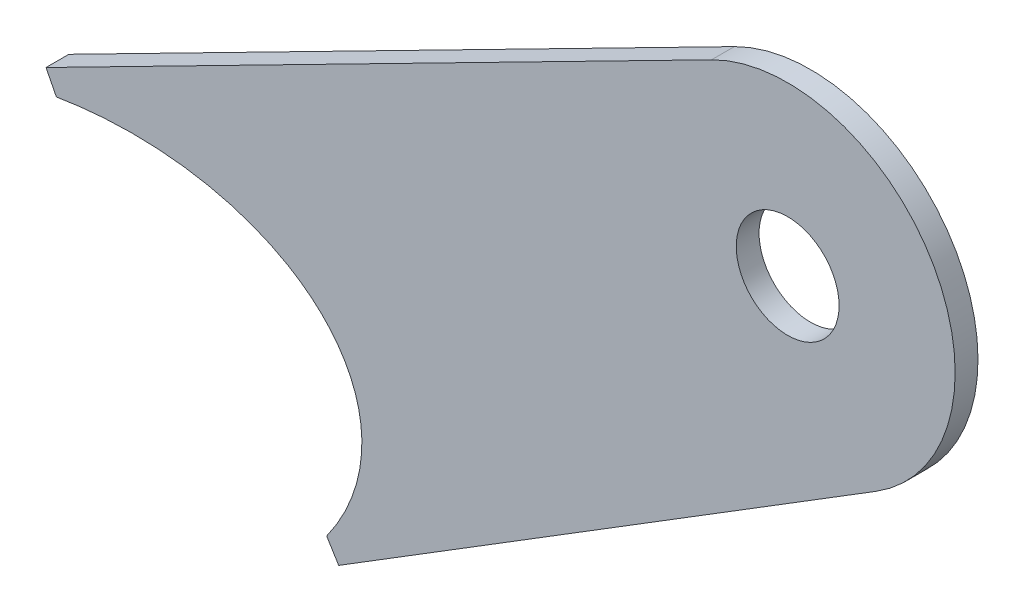
ISO-10303-21;
HEADER;
FILE_DESCRIPTION(('STEP AP214'),'2;1');
FILE_NAME('part.step','',(''),(''),'','','');
FILE_SCHEMA(('AUTOMOTIVE_DESIGN { 1 0 10303 214 1 1 1 1 }'));
ENDSEC;
DATA;
#1=APPLICATION_CONTEXT('core data for automotive mechanical design processes');
#2=APPLICATION_PROTOCOL_DEFINITION('international standard','automotive_design',2000,#1);
#3=PRODUCT_CONTEXT('',#1,'mechanical');
#4=PRODUCT('Part','Part','',(#3));
#5=PRODUCT_RELATED_PRODUCT_CATEGORY('part','',(#4));
#6=PRODUCT_DEFINITION_FORMATION('','',#4);
#7=PRODUCT_DEFINITION_CONTEXT('part definition',#1,'design');
#8=PRODUCT_DEFINITION('design','',#6,#7);
#9=PRODUCT_DEFINITION_SHAPE('','',#8);
#10=(LENGTH_UNIT() NAMED_UNIT(*) SI_UNIT(.MILLI.,.METRE.));
#11=(NAMED_UNIT(*) PLANE_ANGLE_UNIT() SI_UNIT($,.RADIAN.));
#12=(NAMED_UNIT(*) SI_UNIT($,.STERADIAN.) SOLID_ANGLE_UNIT());
#13=UNCERTAINTY_MEASURE_WITH_UNIT(LENGTH_MEASURE(1.E-05),#10,'distance_accuracy_value','');
#14=(GEOMETRIC_REPRESENTATION_CONTEXT(3) GLOBAL_UNCERTAINTY_ASSIGNED_CONTEXT((#13)) GLOBAL_UNIT_ASSIGNED_CONTEXT((#10,
#11,#12)) REPRESENTATION_CONTEXT('',''));
#15=CARTESIAN_POINT('',(0.,0.,0.));
#16=DIRECTION('',(0.,0.,1.));
#17=DIRECTION('',(1.,0.,0.));
#18=AXIS2_PLACEMENT_3D('',#15,#16,#17);
#19=CARTESIAN_POINT('',(-250.470260929667,229.187061728725,16.5));
#20=DIRECTION('',(0.,0.,1.));
#21=DIRECTION('',(-0.963080813887239,-0.269212454991021,0.));
#22=AXIS2_PLACEMENT_3D('',#19,#20,#21);
#23=ELLIPSE('',#22,20.4718594458185,12.7);
#24=DIRECTION('',(0.,0.,1.));
#25=VECTOR('',#24,1.);
#26=SURFACE_OF_LINEAR_EXTRUSION('',#23,#25);
#27=CARTESIAN_POINT('',(-250.470260929667,229.187061728725,18.));
#28=DIRECTION('',(0.,0.,1.));
#29=DIRECTION('',(-0.963080813887239,-0.269212454991021,0.));
#30=AXIS2_PLACEMENT_3D('',#27,#28,#29);
#31=ELLIPSE('',#30,20.4718594458185,12.7);
#32=CARTESIAN_POINT('',(-232.774246825603,226.075586779708,18.));
#33=VERTEX_POINT('',#32);
#34=CARTESIAN_POINT('',(-250.524074665477,242.170966407216,18.));
#35=VERTEX_POINT('',#34);
#36=EDGE_CURVE('E123',#33,#35,#31,.T.);
#37=ORIENTED_EDGE('',*,*,#36,.T.);
#38=DIRECTION('',(0.,0.,1.));
#39=VECTOR('',#38,1.);
#40=CARTESIAN_POINT('',(-250.524074665477,242.170966407216,16.5));
#41=LINE('',#40,#39);
#42=CARTESIAN_POINT('',(-250.524074665477,242.170966407216,16.5));
#43=VERTEX_POINT('',#42);
#44=EDGE_CURVE('E11',#43,#35,#41,.T.);
#45=ORIENTED_EDGE('',*,*,#44,.F.);
#46=CARTESIAN_POINT('',(-232.774246825603,226.075586779708,16.5));
#47=VERTEX_POINT('',#46);
#48=EDGE_CURVE('E55',#47,#43,#23,.T.);
#49=ORIENTED_EDGE('',*,*,#48,.F.);
#50=DIRECTION('',(0.,0.,1.));
#51=VECTOR('',#50,1.);
#52=CARTESIAN_POINT('',(-232.774246825603,226.075586779708,16.5));
#53=LINE('',#52,#51);
#54=EDGE_CURVE('E40',#47,#33,#53,.T.);
#55=ORIENTED_EDGE('',*,*,#54,.T.);
#56=EDGE_LOOP('',(#37,#45,#49,#55));
#57=FACE_BOUND('',#56,.T.);
#58=ADVANCED_FACE('F36',(#57),#26,.F.);
#59=CARTESIAN_POINT('',(-100.793397868975,-51.4067134958136,16.5));
#60=DIRECTION('',(-0.89082801396199,-0.454340675639477,0.));
#61=DIRECTION('',(0.454340675639477,-0.89082801396199,0.));
#62=AXIS2_PLACEMENT_3D('',#59,#60,#61);
#63=PLANE('',#62);
#64=DIRECTION('',(0.454340675639477,-0.89082801396199,0.));
#65=VECTOR('',#64,1.);
#66=CARTESIAN_POINT('',(-100.793397868975,-51.4067134958136,18.));
#67=LINE('',#66,#65);
#68=CARTESIAN_POINT('',(-251.205585678936,243.507208428159,18.));
#69=VERTEX_POINT('',#68);
#70=EDGE_CURVE('E132',#69,#35,#67,.T.);
#71=ORIENTED_EDGE('',*,*,#70,.F.);
#72=DIRECTION('',(0.,0.,1.));
#73=VECTOR('',#72,1.);
#74=CARTESIAN_POINT('',(-251.205585678936,243.507208428159,16.5));
#75=LINE('',#74,#73);
#76=CARTESIAN_POINT('',(-251.205585678936,243.507208428159,16.5));
#77=VERTEX_POINT('',#76);
#78=EDGE_CURVE('E46',#77,#69,#75,.T.);
#79=ORIENTED_EDGE('',*,*,#78,.F.);
#80=DIRECTION('',(0.454340675639477,-0.89082801396199,0.));
#81=VECTOR('',#80,1.);
#82=CARTESIAN_POINT('',(-100.793397868975,-51.4067134958136,16.5));
#83=LINE('',#82,#81);
#84=EDGE_CURVE('E110',#77,#43,#83,.T.);
#85=ORIENTED_EDGE('',*,*,#84,.T.);
#86=ORIENTED_EDGE('',*,*,#44,.T.);
#87=EDGE_LOOP('',(#71,#79,#85,#86));
#88=FACE_BOUND('',#87,.T.);
#89=ADVANCED_FACE('F151',(#88),#63,.T.);
#90=CARTESIAN_POINT('',(-150.412187809961,294.913921923972,16.5));
#91=DIRECTION('',(-0.454340675639477,0.89082801396199,0.));
#92=DIRECTION('',(-0.89082801396199,-0.454340675639477,0.));
#93=AXIS2_PLACEMENT_3D('',#90,#91,#92);
#94=PLANE('',#93);
#95=DIRECTION('',(-0.89082801396199,-0.454340675639477,0.));
#96=VECTOR('',#95,1.);
#97=CARTESIAN_POINT('',(-150.412187809961,294.913921923972,18.));
#98=LINE('',#97,#96);
#99=CARTESIAN_POINT('',(-207.497747432034,265.799108153582,18.));
#100=VERTEX_POINT('',#99);
#101=EDGE_CURVE('E99',#100,#69,#98,.T.);
#102=ORIENTED_EDGE('',*,*,#101,.F.);
#103=DIRECTION('',(0.,0.,1.));
#104=VECTOR('',#103,1.);
#105=CARTESIAN_POINT('',(-207.497747432034,265.799108153582,16.5));
#106=LINE('',#105,#104);
#107=CARTESIAN_POINT('',(-207.497747432034,265.799108153582,16.5));
#108=VERTEX_POINT('',#107);
#109=EDGE_CURVE('E95',#108,#100,#106,.T.);
#110=ORIENTED_EDGE('',*,*,#109,.F.);
#111=DIRECTION('',(-0.89082801396199,-0.454340675639477,0.));
#112=VECTOR('',#111,1.);
#113=CARTESIAN_POINT('',(-150.412187809961,294.913921923972,16.5));
#114=LINE('',#113,#112);
#115=EDGE_CURVE('E98',#108,#77,#114,.T.);
#116=ORIENTED_EDGE('',*,*,#115,.T.);
#117=ORIENTED_EDGE('',*,*,#78,.T.);
#118=EDGE_LOOP('',(#102,#110,#116,#117));
#119=FACE_BOUND('',#118,.T.);
#120=ADVANCED_FACE('F97',(#119),#94,.T.);
#121=CARTESIAN_POINT('',(-202.5,256.,16.5));
#122=DIRECTION('',(0.,0.,1.));
#123=DIRECTION('',(1.,0.,0.));
#124=AXIS2_PLACEMENT_3D('',#121,#122,#123);
#125=CYLINDRICAL_SURFACE('',#124,10.9999999999999);
#126=CARTESIAN_POINT('',(-202.5,256.,18.));
#127=DIRECTION('',(0.,0.,1.));
#128=DIRECTION('',(1.,0.,0.));
#129=AXIS2_PLACEMENT_3D('',#126,#127,#128);
#130=CIRCLE('',#129,10.9999999999999);
#131=CARTESIAN_POINT('',(-196.708139187627,246.648297035828,18.));
#132=VERTEX_POINT('',#131);
#133=EDGE_CURVE('E129',#132,#100,#130,.T.);
#134=ORIENTED_EDGE('',*,*,#133,.F.);
#135=DIRECTION('',(0.,0.,1.));
#136=VECTOR('',#135,1.);
#137=CARTESIAN_POINT('',(-196.708139187627,246.648297035828,16.5));
#138=LINE('',#137,#136);
#139=CARTESIAN_POINT('',(-196.708139187627,246.648297035828,16.5));
#140=VERTEX_POINT('',#139);
#141=EDGE_CURVE('E104',#140,#132,#138,.T.);
#142=ORIENTED_EDGE('',*,*,#141,.F.);
#143=CARTESIAN_POINT('',(-202.5,256.,16.5));
#144=DIRECTION('',(0.,0.,1.));
#145=DIRECTION('',(1.,0.,0.));
#146=AXIS2_PLACEMENT_3D('',#143,#144,#145);
#147=CIRCLE('',#146,10.9999999999999);
#148=EDGE_CURVE('E109',#140,#108,#147,.T.);
#149=ORIENTED_EDGE('',*,*,#148,.T.);
#150=ORIENTED_EDGE('',*,*,#109,.T.);
#151=EDGE_LOOP('',(#134,#142,#149,#150));
#152=FACE_BOUND('',#151,.T.);
#153=ADVANCED_FACE('F112',(#152),#125,.T.);
#154=CARTESIAN_POINT('',(-164.942994695902,266.321643835426,16.5));
#155=DIRECTION('',(-0.526532801124783,0.850154814924723,0.));
#156=DIRECTION('',(-0.850154814924723,-0.526532801124783,0.));
#157=AXIS2_PLACEMENT_3D('',#154,#155,#156);
#158=PLANE('',#157);
#159=DIRECTION('',(-0.850154814924723,-0.526532801124784,0.));
#160=VECTOR('',#159,1.);
#161=CARTESIAN_POINT('',(-164.942994695902,266.321643835426,18.));
#162=LINE('',#161,#160);
#163=CARTESIAN_POINT('',(-231.984447623916,224.800354557321,18.));
#164=VERTEX_POINT('',#163);
#165=EDGE_CURVE('E127',#132,#164,#162,.T.);
#166=ORIENTED_EDGE('',*,*,#165,.T.);
#167=DIRECTION('',(0.,0.,1.));
#168=VECTOR('',#167,1.);
#169=CARTESIAN_POINT('',(-231.984447623916,224.800354557321,16.5));
#170=LINE('',#169,#168);
#171=CARTESIAN_POINT('',(-231.984447623916,224.800354557321,16.5));
#172=VERTEX_POINT('',#171);
#173=EDGE_CURVE('E139',#172,#164,#170,.T.);
#174=ORIENTED_EDGE('',*,*,#173,.F.);
#175=DIRECTION('',(-0.850154814924723,-0.526532801124784,0.));
#176=VECTOR('',#175,1.);
#177=CARTESIAN_POINT('',(-164.942994695902,266.321643835426,16.5));
#178=LINE('',#177,#176);
#179=EDGE_CURVE('E114',#140,#172,#178,.T.);
#180=ORIENTED_EDGE('',*,*,#179,.F.);
#181=ORIENTED_EDGE('',*,*,#141,.T.);
#182=EDGE_LOOP('',(#166,#174,#180,#181));
#183=FACE_BOUND('',#182,.T.);
#184=ADVANCED_FACE('F165',(#183),#158,.F.);
#185=CARTESIAN_POINT('',(-67.041452928015,-41.5212892781047,16.5));
#186=DIRECTION('',(0.850154814924723,0.526532801124783,0.));
#187=DIRECTION('',(-0.526532801124783,0.850154814924723,0.));
#188=AXIS2_PLACEMENT_3D('',#185,#186,#187);
#189=PLANE('',#188);
#190=DIRECTION('',(-0.526532801124783,0.850154814924723,0.));
#191=VECTOR('',#190,1.);
#192=CARTESIAN_POINT('',(-67.041452928015,-41.5212892781047,18.));
#193=LINE('',#192,#191);
#194=EDGE_CURVE('E125',#164,#33,#193,.T.);
#195=ORIENTED_EDGE('',*,*,#194,.T.);
#196=ORIENTED_EDGE('',*,*,#54,.F.);
#197=DIRECTION('',(-0.526532801124783,0.850154814924723,0.));
#198=VECTOR('',#197,1.);
#199=CARTESIAN_POINT('',(-67.041452928015,-41.5212892781047,16.5));
#200=LINE('',#199,#198);
#201=EDGE_CURVE('E88',#172,#47,#200,.T.);
#202=ORIENTED_EDGE('',*,*,#201,.F.);
#203=ORIENTED_EDGE('',*,*,#173,.T.);
#204=EDGE_LOOP('',(#195,#196,#202,#203));
#205=FACE_BOUND('',#204,.T.);
#206=ADVANCED_FACE('F167',(#205),#189,.F.);
#207=CARTESIAN_POINT('',(-202.5,256.,16.5));
#208=DIRECTION('',(0.,0.,1.));
#209=DIRECTION('',(1.,0.,0.));
#210=AXIS2_PLACEMENT_3D('',#207,#208,#209);
#211=CYLINDRICAL_SURFACE('',#210,3.37819999999999);
#212=CARTESIAN_POINT('',(-202.5,256.,16.5));
#213=DIRECTION('',(0.,0.,1.));
#214=DIRECTION('',(1.,0.,0.));
#215=AXIS2_PLACEMENT_3D('',#212,#213,#214);
#216=CIRCLE('',#215,3.37819999999999);
#217=CARTESIAN_POINT('',(-199.1218,256.,16.5));
#218=VERTEX_POINT('',#217);
#219=EDGE_CURVE('E120',#218,#218,#216,.T.);
#220=ORIENTED_EDGE('',*,*,#219,.F.);
#221=EDGE_LOOP('',(#220));
#222=FACE_BOUND('',#221,.T.);
#223=CARTESIAN_POINT('',(-202.5,256.,18.));
#224=DIRECTION('',(0.,0.,1.));
#225=DIRECTION('',(1.,0.,0.));
#226=AXIS2_PLACEMENT_3D('',#223,#224,#225);
#227=CIRCLE('',#226,3.37819999999999);
#228=CARTESIAN_POINT('',(-199.1218,256.,18.));
#229=VERTEX_POINT('',#228);
#230=EDGE_CURVE('E135',#229,#229,#227,.T.);
#231=ORIENTED_EDGE('',*,*,#230,.T.);
#232=EDGE_LOOP('',(#231));
#233=FACE_BOUND('',#232,.T.);
#234=ADVANCED_FACE('F160',(#222,#233),#211,.F.);
#235=CARTESIAN_POINT('',(0.,0.,16.5));
#236=DIRECTION('',(0.,0.,1.));
#237=DIRECTION('',(1.,0.,0.));
#238=AXIS2_PLACEMENT_3D('',#235,#236,#237);
#239=PLANE('',#238);
#240=ORIENTED_EDGE('',*,*,#48,.T.);
#241=ORIENTED_EDGE('',*,*,#84,.F.);
#242=ORIENTED_EDGE('',*,*,#115,.F.);
#243=ORIENTED_EDGE('',*,*,#148,.F.);
#244=ORIENTED_EDGE('',*,*,#179,.T.);
#245=ORIENTED_EDGE('',*,*,#201,.T.);
#246=EDGE_LOOP('',(#240,#241,#242,#243,#244,#245));
#247=FACE_BOUND('',#246,.T.);
#248=ORIENTED_EDGE('',*,*,#219,.T.);
#249=EDGE_LOOP('',(#248));
#250=FACE_BOUND('',#249,.T.);
#251=ADVANCED_FACE('F107',(#247,#250),#239,.F.);
#252=CARTESIAN_POINT('',(0.,0.,18.));
#253=DIRECTION('',(0.,0.,1.));
#254=DIRECTION('',(1.,0.,0.));
#255=AXIS2_PLACEMENT_3D('',#252,#253,#254);
#256=PLANE('',#255);
#257=ORIENTED_EDGE('',*,*,#36,.F.);
#258=ORIENTED_EDGE('',*,*,#194,.F.);
#259=ORIENTED_EDGE('',*,*,#165,.F.);
#260=ORIENTED_EDGE('',*,*,#133,.T.);
#261=ORIENTED_EDGE('',*,*,#101,.T.);
#262=ORIENTED_EDGE('',*,*,#70,.T.);
#263=EDGE_LOOP('',(#257,#258,#259,#260,#261,#262));
#264=FACE_BOUND('',#263,.T.);
#265=ORIENTED_EDGE('',*,*,#230,.F.);
#266=EDGE_LOOP('',(#265));
#267=FACE_BOUND('',#266,.T.);
#268=ADVANCED_FACE('F148',(#264,#267),#256,.T.);
#269=CLOSED_SHELL('',(#58,#89,#120,#153,#184,#206,#234,#251,#268));
#270=MANIFOLD_SOLID_BREP('B2',#269);
#271=ADVANCED_BREP_SHAPE_REPRESENTATION('',(#18,#270),#14);
#272=SHAPE_DEFINITION_REPRESENTATION(#9,#271);
ENDSEC;
END-ISO-10303-21;
